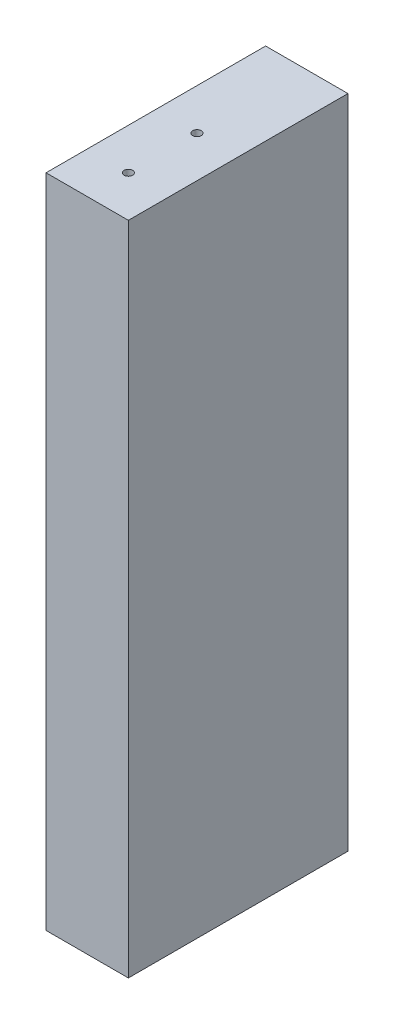
ISO-10303-21;
HEADER;
FILE_DESCRIPTION(('STEP AP214'),'2;1');
FILE_NAME('part.step','',(''),(''),'','','');
FILE_SCHEMA(('AUTOMOTIVE_DESIGN { 1 0 10303 214 1 1 1 1 }'));
ENDSEC;
DATA;
#1=APPLICATION_CONTEXT('core data for automotive mechanical design processes');
#2=APPLICATION_PROTOCOL_DEFINITION('international standard','automotive_design',2000,#1);
#3=PRODUCT_CONTEXT('',#1,'mechanical');
#4=PRODUCT('Part','Part','',(#3));
#5=PRODUCT_RELATED_PRODUCT_CATEGORY('part','',(#4));
#6=PRODUCT_DEFINITION_FORMATION('','',#4);
#7=PRODUCT_DEFINITION_CONTEXT('part definition',#1,'design');
#8=PRODUCT_DEFINITION('design','',#6,#7);
#9=PRODUCT_DEFINITION_SHAPE('','',#8);
#10=(LENGTH_UNIT() NAMED_UNIT(*) SI_UNIT(.MILLI.,.METRE.));
#11=(NAMED_UNIT(*) PLANE_ANGLE_UNIT() SI_UNIT($,.RADIAN.));
#12=(NAMED_UNIT(*) SI_UNIT($,.STERADIAN.) SOLID_ANGLE_UNIT());
#13=UNCERTAINTY_MEASURE_WITH_UNIT(LENGTH_MEASURE(1.E-05),#10,'distance_accuracy_value','');
#14=(GEOMETRIC_REPRESENTATION_CONTEXT(3) GLOBAL_UNCERTAINTY_ASSIGNED_CONTEXT((#13)) GLOBAL_UNIT_ASSIGNED_CONTEXT((#10,
#11,#12)) REPRESENTATION_CONTEXT('',''));
#15=CARTESIAN_POINT('',(0.,0.,0.));
#16=DIRECTION('',(0.,0.,1.));
#17=DIRECTION('',(1.,0.,0.));
#18=AXIS2_PLACEMENT_3D('',#15,#16,#17);
#19=CARTESIAN_POINT('',(461.971826131454,6450.33,50.8));
#20=DIRECTION('',(-1.,0.,0.));
#21=DIRECTION('',(0.,0.,1.));
#22=AXIS2_PLACEMENT_3D('',#19,#20,#21);
#23=PLANE('',#22);
#24=DIRECTION('',(0.,1.,0.));
#25=VECTOR('',#24,1.);
#26=CARTESIAN_POINT('',(461.971826131454,6450.33,0.));
#27=LINE('',#26,#25);
#28=CARTESIAN_POINT('',(461.971826131454,6450.33,0.));
#29=VERTEX_POINT('',#28);
#30=CARTESIAN_POINT('',(461.971826131454,6602.1458,0.));
#31=VERTEX_POINT('',#30);
#32=EDGE_CURVE('E147',#29,#31,#27,.T.);
#33=ORIENTED_EDGE('',*,*,#32,.T.);
#34=DIRECTION('',(0.,0.,-1.));
#35=VECTOR('',#34,1.);
#36=CARTESIAN_POINT('',(461.971826131454,6602.1458,50.8));
#37=LINE('',#36,#35);
#38=CARTESIAN_POINT('',(461.971826131454,6602.1458,50.8));
#39=VERTEX_POINT('',#38);
#40=EDGE_CURVE('E11',#39,#31,#37,.T.);
#41=ORIENTED_EDGE('',*,*,#40,.F.);
#42=DIRECTION('',(0.,1.,0.));
#43=VECTOR('',#42,1.);
#44=CARTESIAN_POINT('',(461.971826131454,6450.33,50.8));
#45=LINE('',#44,#43);
#46=CARTESIAN_POINT('',(461.971826131454,6450.33,50.8));
#47=VERTEX_POINT('',#46);
#48=EDGE_CURVE('E140',#47,#39,#45,.T.);
#49=ORIENTED_EDGE('',*,*,#48,.F.);
#50=DIRECTION('',(0.,0.,-1.));
#51=VECTOR('',#50,1.);
#52=CARTESIAN_POINT('',(461.971826131454,6450.33,50.8));
#53=LINE('',#52,#51);
#54=EDGE_CURVE('E146',#47,#29,#53,.T.);
#55=ORIENTED_EDGE('',*,*,#54,.T.);
#56=EDGE_LOOP('',(#33,#41,#49,#55));
#57=FACE_BOUND('',#56,.T.);
#58=ADVANCED_FACE('F32',(#57),#23,.F.);
#59=CARTESIAN_POINT('',(461.971826131454,6602.1458,50.8));
#60=DIRECTION('',(0.,-1.,0.));
#61=DIRECTION('',(0.,0.,-1.));
#62=AXIS2_PLACEMENT_3D('',#59,#60,#61);
#63=PLANE('',#62);
#64=CARTESIAN_POINT('',(452.446826131454,6602.1458,25.4));
#65=DIRECTION('',(0.,1.,0.));
#66=DIRECTION('',(0.,0.,1.));
#67=AXIS2_PLACEMENT_3D('',#64,#65,#66);
#68=CIRCLE('',#67,0.992251);
#69=CARTESIAN_POINT('',(452.446826131454,6602.1458,26.392251));
#70=VERTEX_POINT('',#69);
#71=EDGE_CURVE('E121',#70,#70,#68,.T.);
#72=ORIENTED_EDGE('',*,*,#71,.F.);
#73=EDGE_LOOP('',(#72));
#74=FACE_BOUND('',#73,.T.);
#75=CARTESIAN_POINT('',(452.446826131454,6602.1458,41.275));
#76=DIRECTION('',(0.,1.,0.));
#77=DIRECTION('',(0.,0.,1.));
#78=AXIS2_PLACEMENT_3D('',#75,#76,#77);
#79=CIRCLE('',#78,0.992251);
#80=CARTESIAN_POINT('',(452.446826131454,6602.1458,42.267251));
#81=VERTEX_POINT('',#80);
#82=EDGE_CURVE('E127',#81,#81,#79,.T.);
#83=ORIENTED_EDGE('',*,*,#82,.F.);
#84=EDGE_LOOP('',(#83));
#85=FACE_BOUND('',#84,.T.);
#86=DIRECTION('',(-1.,0.,0.));
#87=VECTOR('',#86,1.);
#88=CARTESIAN_POINT('',(461.971826131454,6602.1458,0.));
#89=LINE('',#88,#87);
#90=CARTESIAN_POINT('',(442.921826131454,6602.1458,0.));
#91=VERTEX_POINT('',#90);
#92=EDGE_CURVE('E150',#31,#91,#89,.T.);
#93=ORIENTED_EDGE('',*,*,#92,.T.);
#94=DIRECTION('',(0.,0.,-1.));
#95=VECTOR('',#94,1.);
#96=CARTESIAN_POINT('',(442.921826131454,6602.1458,50.8));
#97=LINE('',#96,#95);
#98=CARTESIAN_POINT('',(442.921826131454,6602.1458,50.8));
#99=VERTEX_POINT('',#98);
#100=EDGE_CURVE('E41',#99,#91,#97,.T.);
#101=ORIENTED_EDGE('',*,*,#100,.F.);
#102=DIRECTION('',(-1.,0.,0.));
#103=VECTOR('',#102,1.);
#104=CARTESIAN_POINT('',(461.971826131454,6602.1458,50.8));
#105=LINE('',#104,#103);
#106=EDGE_CURVE('E81',#39,#99,#105,.T.);
#107=ORIENTED_EDGE('',*,*,#106,.F.);
#108=ORIENTED_EDGE('',*,*,#40,.T.);
#109=EDGE_LOOP('',(#93,#101,#107,#108));
#110=FACE_BOUND('',#109,.T.);
#111=ADVANCED_FACE('F181',(#74,#85,#110),#63,.F.);
#112=CARTESIAN_POINT('',(442.921826131454,6450.33,50.8));
#113=DIRECTION('',(1.,0.,0.));
#114=DIRECTION('',(0.,0.,-1.));
#115=AXIS2_PLACEMENT_3D('',#112,#113,#114);
#116=PLANE('',#115);
#117=DIRECTION('',(0.,-1.,0.));
#118=VECTOR('',#117,1.);
#119=CARTESIAN_POINT('',(442.921826131454,6450.33,0.));
#120=LINE('',#119,#118);
#121=CARTESIAN_POINT('',(442.921826131454,6450.33,0.));
#122=VERTEX_POINT('',#121);
#123=EDGE_CURVE('E68',#91,#122,#120,.T.);
#124=ORIENTED_EDGE('',*,*,#123,.T.);
#125=DIRECTION('',(0.,0.,-1.));
#126=VECTOR('',#125,1.);
#127=CARTESIAN_POINT('',(442.921826131454,6450.33,50.8));
#128=LINE('',#127,#126);
#129=CARTESIAN_POINT('',(442.921826131454,6450.33,50.8));
#130=VERTEX_POINT('',#129);
#131=EDGE_CURVE('E155',#130,#122,#128,.T.);
#132=ORIENTED_EDGE('',*,*,#131,.F.);
#133=DIRECTION('',(0.,-1.,0.));
#134=VECTOR('',#133,1.);
#135=CARTESIAN_POINT('',(442.921826131454,6450.33,50.8));
#136=LINE('',#135,#134);
#137=EDGE_CURVE('E143',#99,#130,#136,.T.);
#138=ORIENTED_EDGE('',*,*,#137,.F.);
#139=ORIENTED_EDGE('',*,*,#100,.T.);
#140=EDGE_LOOP('',(#124,#132,#138,#139));
#141=FACE_BOUND('',#140,.T.);
#142=ADVANCED_FACE('F186',(#141),#116,.F.);
#143=CARTESIAN_POINT('',(461.971826131454,6450.33,50.8));
#144=DIRECTION('',(0.,1.,0.));
#145=DIRECTION('',(0.,0.,1.));
#146=AXIS2_PLACEMENT_3D('',#143,#144,#145);
#147=PLANE('',#146);
#148=CARTESIAN_POINT('',(452.446826131454,6450.33,41.275));
#149=DIRECTION('',(0.,-1.,0.));
#150=DIRECTION('',(0.,0.,-1.));
#151=AXIS2_PLACEMENT_3D('',#148,#149,#150);
#152=CIRCLE('',#151,0.992251);
#153=CARTESIAN_POINT('',(452.446826131454,6450.33,40.282749));
#154=VERTEX_POINT('',#153);
#155=EDGE_CURVE('E111',#154,#154,#152,.T.);
#156=ORIENTED_EDGE('',*,*,#155,.F.);
#157=EDGE_LOOP('',(#156));
#158=FACE_BOUND('',#157,.T.);
#159=CARTESIAN_POINT('',(452.446826131454,6450.33,25.4));
#160=DIRECTION('',(0.,-1.,0.));
#161=DIRECTION('',(0.,0.,-1.));
#162=AXIS2_PLACEMENT_3D('',#159,#160,#161);
#163=CIRCLE('',#162,0.992251);
#164=CARTESIAN_POINT('',(452.446826131454,6450.33,24.407749));
#165=VERTEX_POINT('',#164);
#166=EDGE_CURVE('E110',#165,#165,#163,.T.);
#167=ORIENTED_EDGE('',*,*,#166,.F.);
#168=EDGE_LOOP('',(#167));
#169=FACE_BOUND('',#168,.T.);
#170=DIRECTION('',(1.,0.,0.));
#171=VECTOR('',#170,1.);
#172=CARTESIAN_POINT('',(461.971826131454,6450.33,0.));
#173=LINE('',#172,#171);
#174=EDGE_CURVE('E74',#122,#29,#173,.T.);
#175=ORIENTED_EDGE('',*,*,#174,.T.);
#176=ORIENTED_EDGE('',*,*,#54,.F.);
#177=DIRECTION('',(1.,0.,0.));
#178=VECTOR('',#177,1.);
#179=CARTESIAN_POINT('',(461.971826131454,6450.33,50.8));
#180=LINE('',#179,#178);
#181=EDGE_CURVE('E50',#130,#47,#180,.T.);
#182=ORIENTED_EDGE('',*,*,#181,.F.);
#183=ORIENTED_EDGE('',*,*,#131,.T.);
#184=EDGE_LOOP('',(#175,#176,#182,#183));
#185=FACE_BOUND('',#184,.T.);
#186=ADVANCED_FACE('F193',(#158,#169,#185),#147,.F.);
#187=CARTESIAN_POINT('',(0.,0.,50.8));
#188=DIRECTION('',(0.,0.,1.));
#189=DIRECTION('',(1.,0.,0.));
#190=AXIS2_PLACEMENT_3D('',#187,#188,#189);
#191=PLANE('',#190);
#192=ORIENTED_EDGE('',*,*,#48,.T.);
#193=ORIENTED_EDGE('',*,*,#106,.T.);
#194=ORIENTED_EDGE('',*,*,#137,.T.);
#195=ORIENTED_EDGE('',*,*,#181,.T.);
#196=EDGE_LOOP('',(#192,#193,#194,#195));
#197=FACE_BOUND('',#196,.T.);
#198=ADVANCED_FACE('F175',(#197),#191,.T.);
#199=CARTESIAN_POINT('',(0.,0.,0.));
#200=DIRECTION('',(0.,0.,1.));
#201=DIRECTION('',(1.,0.,0.));
#202=AXIS2_PLACEMENT_3D('',#199,#200,#201);
#203=PLANE('',#202);
#204=CARTESIAN_POINT('',(452.446826131454,6488.1379,0.));
#205=DIRECTION('',(0.,0.,1.));
#206=DIRECTION('',(1.,0.,0.));
#207=AXIS2_PLACEMENT_3D('',#204,#205,#206);
#208=CIRCLE('',#207,0.992251);
#209=CARTESIAN_POINT('',(453.439077131454,6488.1379,0.));
#210=VERTEX_POINT('',#209);
#211=EDGE_CURVE('E35',#210,#210,#208,.T.);
#212=ORIENTED_EDGE('',*,*,#211,.T.);
#213=EDGE_LOOP('',(#212));
#214=FACE_BOUND('',#213,.T.);
#215=CARTESIAN_POINT('',(452.446826131454,6564.3379,0.));
#216=DIRECTION('',(0.,0.,1.));
#217=DIRECTION('',(1.,0.,0.));
#218=AXIS2_PLACEMENT_3D('',#215,#216,#217);
#219=CIRCLE('',#218,0.992251);
#220=CARTESIAN_POINT('',(453.439077131454,6564.3379,0.));
#221=VERTEX_POINT('',#220);
#222=EDGE_CURVE('E139',#221,#221,#219,.T.);
#223=ORIENTED_EDGE('',*,*,#222,.T.);
#224=EDGE_LOOP('',(#223));
#225=FACE_BOUND('',#224,.T.);
#226=ORIENTED_EDGE('',*,*,#32,.F.);
#227=ORIENTED_EDGE('',*,*,#174,.F.);
#228=ORIENTED_EDGE('',*,*,#123,.F.);
#229=ORIENTED_EDGE('',*,*,#92,.F.);
#230=EDGE_LOOP('',(#226,#227,#228,#229));
#231=FACE_BOUND('',#230,.T.);
#232=ADVANCED_FACE('F160',(#214,#225,#231),#203,.F.);
#233=CARTESIAN_POINT('',(452.446826131454,6564.3379,-19.0500000000009));
#234=DIRECTION('',(0.,0.,-1.));
#235=DIRECTION('',(-1.,0.,0.));
#236=AXIS2_PLACEMENT_3D('',#233,#234,#235);
#237=CYLINDRICAL_SURFACE('',#236,0.992251);
#238=CARTESIAN_POINT('',(452.446826131454,6564.3379,19.0499999999991));
#239=DIRECTION('',(0.,0.,-1.));
#240=DIRECTION('',(-1.,0.,0.));
#241=AXIS2_PLACEMENT_3D('',#238,#239,#240);
#242=CIRCLE('',#241,0.992251);
#243=CARTESIAN_POINT('',(451.454575131454,6564.3379,19.0499999999991));
#244=VERTEX_POINT('',#243);
#245=EDGE_CURVE('E136',#244,#244,#242,.T.);
#246=ORIENTED_EDGE('',*,*,#245,.F.);
#247=EDGE_LOOP('',(#246));
#248=FACE_BOUND('',#247,.T.);
#249=ORIENTED_EDGE('',*,*,#222,.F.);
#250=EDGE_LOOP('',(#249));
#251=FACE_BOUND('',#250,.T.);
#252=ADVANCED_FACE('F163',(#248,#251),#237,.F.);
#253=CARTESIAN_POINT('',(452.446826131454,6564.3379,19.0499999999991));
#254=DIRECTION('',(0.,0.,-1.));
#255=DIRECTION('',(-1.,0.,0.));
#256=AXIS2_PLACEMENT_3D('',#253,#254,#255);
#257=CONICAL_SURFACE('',#256,0.992251,1.02974425867666);
#258=CARTESIAN_POINT('',(452.446826131454,6564.3379,19.6462045500898));
#259=VERTEX_POINT('',#258);
#260=VERTEX_LOOP('',#259);
#261=FACE_BOUND('',#260,.T.);
#262=ORIENTED_EDGE('',*,*,#245,.T.);
#263=EDGE_LOOP('',(#262));
#264=FACE_BOUND('',#263,.T.);
#265=ADVANCED_FACE('F165',(#261,#264),#257,.F.);
#266=CARTESIAN_POINT('',(452.446826131454,6488.1379,-19.0500000000009));
#267=DIRECTION('',(0.,0.,-1.));
#268=DIRECTION('',(-1.,0.,0.));
#269=AXIS2_PLACEMENT_3D('',#266,#267,#268);
#270=CYLINDRICAL_SURFACE('',#269,0.992251);
#271=CARTESIAN_POINT('',(452.446826131454,6488.1379,19.0499999999991));
#272=DIRECTION('',(0.,0.,-1.));
#273=DIRECTION('',(-1.,0.,0.));
#274=AXIS2_PLACEMENT_3D('',#271,#272,#273);
#275=CIRCLE('',#274,0.992251);
#276=CARTESIAN_POINT('',(451.454575131454,6488.1379,19.0499999999991));
#277=VERTEX_POINT('',#276);
#278=EDGE_CURVE('E133',#277,#277,#275,.T.);
#279=ORIENTED_EDGE('',*,*,#278,.F.);
#280=EDGE_LOOP('',(#279));
#281=FACE_BOUND('',#280,.T.);
#282=ORIENTED_EDGE('',*,*,#211,.F.);
#283=EDGE_LOOP('',(#282));
#284=FACE_BOUND('',#283,.T.);
#285=ADVANCED_FACE('F172',(#281,#284),#270,.F.);
#286=CARTESIAN_POINT('',(452.446826131454,6488.1379,19.0499999999991));
#287=DIRECTION('',(0.,0.,-1.));
#288=DIRECTION('',(-1.,0.,0.));
#289=AXIS2_PLACEMENT_3D('',#286,#287,#288);
#290=CONICAL_SURFACE('',#289,0.992251,1.02974425867666);
#291=CARTESIAN_POINT('',(452.446826131454,6488.1379,19.6462045500898));
#292=VERTEX_POINT('',#291);
#293=VERTEX_LOOP('',#292);
#294=FACE_BOUND('',#293,.T.);
#295=ORIENTED_EDGE('',*,*,#278,.T.);
#296=EDGE_LOOP('',(#295));
#297=FACE_BOUND('',#296,.T.);
#298=ADVANCED_FACE('F269',(#294,#297),#290,.F.);
#299=CARTESIAN_POINT('',(452.446826131454,6583.0958,41.275));
#300=DIRECTION('',(0.,1.,0.));
#301=DIRECTION('',(0.,0.,1.));
#302=AXIS2_PLACEMENT_3D('',#299,#300,#301);
#303=CONICAL_SURFACE('',#302,0.992251,1.02974425867684);
#304=CARTESIAN_POINT('',(452.446826131454,6582.49959544991,41.275));
#305=VERTEX_POINT('',#304);
#306=VERTEX_LOOP('',#305);
#307=FACE_BOUND('',#306,.T.);
#308=CARTESIAN_POINT('',(452.446826131454,6583.0958,41.275));
#309=DIRECTION('',(0.,1.,0.));
#310=DIRECTION('',(0.,0.,1.));
#311=AXIS2_PLACEMENT_3D('',#308,#309,#310);
#312=CIRCLE('',#311,0.992251);
#313=CARTESIAN_POINT('',(452.446826131454,6583.0958,42.267251));
#314=VERTEX_POINT('',#313);
#315=EDGE_CURVE('E130',#314,#314,#312,.T.);
#316=ORIENTED_EDGE('',*,*,#315,.T.);
#317=EDGE_LOOP('',(#316));
#318=FACE_BOUND('',#317,.T.);
#319=ADVANCED_FACE('F265',(#307,#318),#303,.F.);
#320=CARTESIAN_POINT('',(452.446826131454,6602.1458,41.275));
#321=DIRECTION('',(0.,1.,0.));
#322=DIRECTION('',(0.,0.,1.));
#323=AXIS2_PLACEMENT_3D('',#320,#321,#322);
#324=CYLINDRICAL_SURFACE('',#323,0.992251);
#325=ORIENTED_EDGE('',*,*,#315,.F.);
#326=EDGE_LOOP('',(#325));
#327=FACE_BOUND('',#326,.T.);
#328=ORIENTED_EDGE('',*,*,#82,.T.);
#329=EDGE_LOOP('',(#328));
#330=FACE_BOUND('',#329,.T.);
#331=ADVANCED_FACE('F261',(#327,#330),#324,.F.);
#332=CARTESIAN_POINT('',(452.446826131454,6583.0958,25.4));
#333=DIRECTION('',(0.,1.,0.));
#334=DIRECTION('',(0.,0.,1.));
#335=AXIS2_PLACEMENT_3D('',#332,#333,#334);
#336=CONICAL_SURFACE('',#335,0.992251,1.02974425867684);
#337=CARTESIAN_POINT('',(452.446826131454,6582.49959544991,25.4));
#338=VERTEX_POINT('',#337);
#339=VERTEX_LOOP('',#338);
#340=FACE_BOUND('',#339,.T.);
#341=CARTESIAN_POINT('',(452.446826131454,6583.0958,25.4));
#342=DIRECTION('',(0.,1.,0.));
#343=DIRECTION('',(0.,0.,1.));
#344=AXIS2_PLACEMENT_3D('',#341,#342,#343);
#345=CIRCLE('',#344,0.992251);
#346=CARTESIAN_POINT('',(452.446826131454,6583.0958,26.392251));
#347=VERTEX_POINT('',#346);
#348=EDGE_CURVE('E124',#347,#347,#345,.T.);
#349=ORIENTED_EDGE('',*,*,#348,.T.);
#350=EDGE_LOOP('',(#349));
#351=FACE_BOUND('',#350,.T.);
#352=ADVANCED_FACE('F257',(#340,#351),#336,.F.);
#353=CARTESIAN_POINT('',(452.446826131454,6602.1458,25.4));
#354=DIRECTION('',(0.,1.,0.));
#355=DIRECTION('',(0.,0.,1.));
#356=AXIS2_PLACEMENT_3D('',#353,#354,#355);
#357=CYLINDRICAL_SURFACE('',#356,0.992251);
#358=ORIENTED_EDGE('',*,*,#348,.F.);
#359=EDGE_LOOP('',(#358));
#360=FACE_BOUND('',#359,.T.);
#361=ORIENTED_EDGE('',*,*,#71,.T.);
#362=EDGE_LOOP('',(#361));
#363=FACE_BOUND('',#362,.T.);
#364=ADVANCED_FACE('F217',(#360,#363),#357,.F.);
#365=CARTESIAN_POINT('',(452.446826131454,6469.38,25.4));
#366=DIRECTION('',(0.,-1.,0.));
#367=DIRECTION('',(0.,0.,-1.));
#368=AXIS2_PLACEMENT_3D('',#365,#366,#367);
#369=CONICAL_SURFACE('',#368,0.992251,1.02974425867684);
#370=CARTESIAN_POINT('',(452.446826131454,6469.97620455009,25.4));
#371=VERTEX_POINT('',#370);
#372=VERTEX_LOOP('',#371);
#373=FACE_BOUND('',#372,.T.);
#374=CARTESIAN_POINT('',(452.446826131454,6469.38,25.4));
#375=DIRECTION('',(0.,-1.,0.));
#376=DIRECTION('',(0.,0.,-1.));
#377=AXIS2_PLACEMENT_3D('',#374,#375,#376);
#378=CIRCLE('',#377,0.992251);
#379=CARTESIAN_POINT('',(452.446826131454,6469.38,24.407749));
#380=VERTEX_POINT('',#379);
#381=EDGE_CURVE('E114',#380,#380,#378,.T.);
#382=ORIENTED_EDGE('',*,*,#381,.T.);
#383=EDGE_LOOP('',(#382));
#384=FACE_BOUND('',#383,.T.);
#385=ADVANCED_FACE('F222',(#373,#384),#369,.F.);
#386=CARTESIAN_POINT('',(452.446826131454,6450.33,25.4));
#387=DIRECTION('',(0.,-1.,0.));
#388=DIRECTION('',(0.,0.,-1.));
#389=AXIS2_PLACEMENT_3D('',#386,#387,#388);
#390=CYLINDRICAL_SURFACE('',#389,0.992251);
#391=ORIENTED_EDGE('',*,*,#381,.F.);
#392=EDGE_LOOP('',(#391));
#393=FACE_BOUND('',#392,.T.);
#394=ORIENTED_EDGE('',*,*,#166,.T.);
#395=EDGE_LOOP('',(#394));
#396=FACE_BOUND('',#395,.T.);
#397=ADVANCED_FACE('F104',(#393,#396),#390,.F.);
#398=CARTESIAN_POINT('',(452.446826131454,6469.38,41.275));
#399=DIRECTION('',(0.,-1.,0.));
#400=DIRECTION('',(0.,0.,-1.));
#401=AXIS2_PLACEMENT_3D('',#398,#399,#400);
#402=CONICAL_SURFACE('',#401,0.992251,1.02974425867684);
#403=CARTESIAN_POINT('',(452.446826131454,6469.97620455009,41.275));
#404=VERTEX_POINT('',#403);
#405=VERTEX_LOOP('',#404);
#406=FACE_BOUND('',#405,.T.);
#407=CARTESIAN_POINT('',(452.446826131454,6469.38,41.275));
#408=DIRECTION('',(0.,-1.,0.));
#409=DIRECTION('',(0.,0.,-1.));
#410=AXIS2_PLACEMENT_3D('',#407,#408,#409);
#411=CIRCLE('',#410,0.992251);
#412=CARTESIAN_POINT('',(452.446826131454,6469.38,40.282749));
#413=VERTEX_POINT('',#412);
#414=EDGE_CURVE('E108',#413,#413,#411,.T.);
#415=ORIENTED_EDGE('',*,*,#414,.T.);
#416=EDGE_LOOP('',(#415));
#417=FACE_BOUND('',#416,.T.);
#418=ADVANCED_FACE('F100',(#406,#417),#402,.F.);
#419=CARTESIAN_POINT('',(452.446826131454,6450.33,41.275));
#420=DIRECTION('',(0.,-1.,0.));
#421=DIRECTION('',(0.,0.,-1.));
#422=AXIS2_PLACEMENT_3D('',#419,#420,#421);
#423=CYLINDRICAL_SURFACE('',#422,0.992251);
#424=ORIENTED_EDGE('',*,*,#414,.F.);
#425=EDGE_LOOP('',(#424));
#426=FACE_BOUND('',#425,.T.);
#427=ORIENTED_EDGE('',*,*,#155,.T.);
#428=EDGE_LOOP('',(#427));
#429=FACE_BOUND('',#428,.T.);
#430=ADVANCED_FACE('F103',(#426,#429),#423,.F.);
#431=CLOSED_SHELL('',(#58,#111,#142,#186,#198,#232,#252,#265,#285,#298,#319,#331,#352,#364,#385,
#397,#418,#430));
#432=MANIFOLD_SOLID_BREP('B2',#431);
#433=ADVANCED_BREP_SHAPE_REPRESENTATION('',(#18,#432),#14);
#434=SHAPE_DEFINITION_REPRESENTATION(#9,#433);
ENDSEC;
END-ISO-10303-21;
